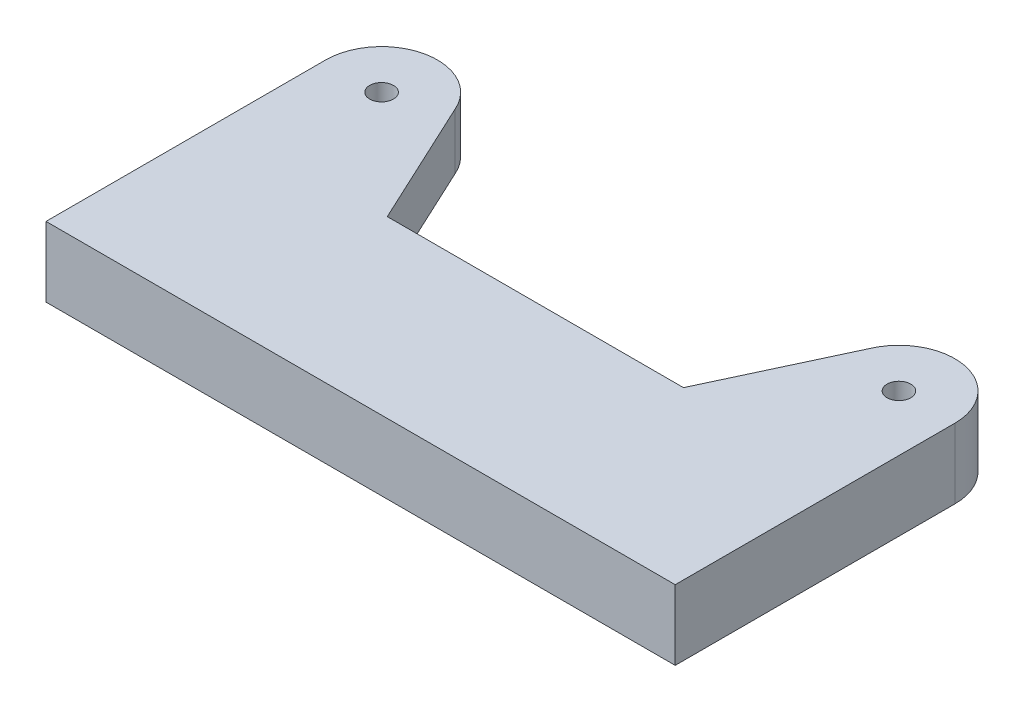
ISO-10303-21;
HEADER;
FILE_DESCRIPTION(('STEP AP214'),'2;1');
FILE_NAME('part.step','',(''),(''),'','','');
FILE_SCHEMA(('AUTOMOTIVE_DESIGN { 1 0 10303 214 1 1 1 1 }'));
ENDSEC;
DATA;
#1=APPLICATION_CONTEXT('core data for automotive mechanical design processes');
#2=APPLICATION_PROTOCOL_DEFINITION('international standard','automotive_design',2000,#1);
#3=PRODUCT_CONTEXT('',#1,'mechanical');
#4=PRODUCT('Part','Part','',(#3));
#5=PRODUCT_RELATED_PRODUCT_CATEGORY('part','',(#4));
#6=PRODUCT_DEFINITION_FORMATION('','',#4);
#7=PRODUCT_DEFINITION_CONTEXT('part definition',#1,'design');
#8=PRODUCT_DEFINITION('design','',#6,#7);
#9=PRODUCT_DEFINITION_SHAPE('','',#8);
#10=(LENGTH_UNIT() NAMED_UNIT(*) SI_UNIT(.MILLI.,.METRE.));
#11=(NAMED_UNIT(*) PLANE_ANGLE_UNIT() SI_UNIT($,.RADIAN.));
#12=(NAMED_UNIT(*) SI_UNIT($,.STERADIAN.) SOLID_ANGLE_UNIT());
#13=UNCERTAINTY_MEASURE_WITH_UNIT(LENGTH_MEASURE(1.E-05),#10,'distance_accuracy_value','');
#14=(GEOMETRIC_REPRESENTATION_CONTEXT(3) GLOBAL_UNCERTAINTY_ASSIGNED_CONTEXT((#13)) GLOBAL_UNIT_ASSIGNED_CONTEXT((#10,
#11,#12)) REPRESENTATION_CONTEXT('',''));
#15=CARTESIAN_POINT('',(0.,0.,0.));
#16=DIRECTION('',(0.,0.,1.));
#17=DIRECTION('',(1.,0.,0.));
#18=AXIS2_PLACEMENT_3D('',#15,#16,#17);
#19=CARTESIAN_POINT('',(0.,2.,0.));
#20=DIRECTION('',(0.,-1.,0.));
#21=DIRECTION('',(0.,0.,-1.));
#22=AXIS2_PLACEMENT_3D('',#19,#20,#21);
#23=PLANE('',#22);
#24=CARTESIAN_POINT('',(-37.,2.,-40.));
#25=DIRECTION('',(0.,-1.,0.));
#26=DIRECTION('',(0.,0.,-1.));
#27=AXIS2_PLACEMENT_3D('',#24,#25,#26);
#28=CIRCLE('',#27,1.7);
#29=CARTESIAN_POINT('',(-37.,2.,-41.7));
#30=VERTEX_POINT('',#29);
#31=EDGE_CURVE('E309',#30,#30,#28,.F.);
#32=ORIENTED_EDGE('',*,*,#31,.T.);
#33=EDGE_LOOP('',(#32));
#34=FACE_BOUND('',#33,.T.);
#35=DIRECTION('',(-1.,0.,0.));
#36=VECTOR('',#35,1.);
#37=CARTESIAN_POINT('',(42.5,2.,-14.9999999999997));
#38=LINE('',#37,#36);
#39=CARTESIAN_POINT('',(41.5,2.,-14.9999999999997));
#40=VERTEX_POINT('',#39);
#41=CARTESIAN_POINT('',(-41.5,2.,-14.9999999999997));
#42=VERTEX_POINT('',#41);
#43=EDGE_CURVE('E157',#40,#42,#38,.T.);
#44=ORIENTED_EDGE('',*,*,#43,.T.);
#45=CARTESIAN_POINT('',(-41.5,2.,-15.9999999999997));
#46=DIRECTION('',(0.,-1.,0.));
#47=DIRECTION('',(0.,0.,-1.));
#48=AXIS2_PLACEMENT_3D('',#45,#46,#47);
#49=CIRCLE('',#48,1.);
#50=CARTESIAN_POINT('',(-42.5,2.,-15.9999999999997));
#51=VERTEX_POINT('',#50);
#52=EDGE_CURVE('E272',#42,#51,#49,.T.);
#53=ORIENTED_EDGE('',*,*,#52,.T.);
#54=DIRECTION('',(0.,0.,-1.));
#55=VECTOR('',#54,1.);
#56=CARTESIAN_POINT('',(-42.5,2.,-47.9999999999999));
#57=LINE('',#56,#55);
#58=CARTESIAN_POINT('',(-42.5,2.,-45.8094750193111));
#59=VERTEX_POINT('',#58);
#60=EDGE_CURVE('E158',#51,#59,#57,.T.);
#61=ORIENTED_EDGE('',*,*,#60,.T.);
#62=CARTESIAN_POINT('',(-37.,2.,-40.));
#63=DIRECTION('',(0.,-1.,0.));
#64=DIRECTION('',(0.,0.,-1.));
#65=AXIS2_PLACEMENT_3D('',#62,#63,#64);
#66=CIRCLE('',#65,7.99999999999995);
#67=CARTESIAN_POINT('',(-29.6360913717861,2.,-43.1261557407327));
#68=VERTEX_POINT('',#67);
#69=EDGE_CURVE('E255',#59,#68,#66,.T.);
#70=ORIENTED_EDGE('',*,*,#69,.T.);
#71=DIRECTION('',(0.422618261740704,0.,0.906307787036648));
#72=VECTOR('',#71,1.);
#73=CARTESIAN_POINT('',(-29.6360913717862,2.,-43.1261557407327));
#74=LINE('',#73,#72);
#75=CARTESIAN_POINT('',(-21.1837261369721,2.,-24.9999999999997));
#76=VERTEX_POINT('',#75);
#77=EDGE_CURVE('E169',#68,#76,#74,.T.);
#78=ORIENTED_EDGE('',*,*,#77,.T.);
#79=DIRECTION('',(1.,0.,0.));
#80=VECTOR('',#79,1.);
#81=CARTESIAN_POINT('',(21.1837261369721,2.,-24.9999999999997));
#82=LINE('',#81,#80);
#83=CARTESIAN_POINT('',(21.1837261369721,2.,-24.9999999999997));
#84=VERTEX_POINT('',#83);
#85=EDGE_CURVE('E178',#76,#84,#82,.T.);
#86=ORIENTED_EDGE('',*,*,#85,.T.);
#87=DIRECTION('',(0.422618261740704,0.,-0.906307787036648));
#88=VECTOR('',#87,1.);
#89=CARTESIAN_POINT('',(29.6360913717862,2.,-43.1261557407327));
#90=LINE('',#89,#88);
#91=CARTESIAN_POINT('',(29.6360913717862,2.,-43.1261557407327));
#92=VERTEX_POINT('',#91);
#93=EDGE_CURVE('E144',#84,#92,#90,.T.);
#94=ORIENTED_EDGE('',*,*,#93,.T.);
#95=CARTESIAN_POINT('',(37.,2.,-40.));
#96=DIRECTION('',(0.,-1.,0.));
#97=DIRECTION('',(0.,0.,-1.));
#98=AXIS2_PLACEMENT_3D('',#95,#96,#97);
#99=CIRCLE('',#98,7.99999999999994);
#100=CARTESIAN_POINT('',(42.5,2.,-45.809475019311));
#101=VERTEX_POINT('',#100);
#102=EDGE_CURVE('E138',#92,#101,#99,.T.);
#103=ORIENTED_EDGE('',*,*,#102,.T.);
#104=DIRECTION('',(0.,0.,1.));
#105=VECTOR('',#104,1.);
#106=CARTESIAN_POINT('',(42.5,2.,-47.9999999999999));
#107=LINE('',#106,#105);
#108=CARTESIAN_POINT('',(42.5,2.,-15.9999999999997));
#109=VERTEX_POINT('',#108);
#110=EDGE_CURVE('E141',#101,#109,#107,.T.);
#111=ORIENTED_EDGE('',*,*,#110,.T.);
#112=CARTESIAN_POINT('',(41.5,2.,-15.9999999999997));
#113=DIRECTION('',(0.,-1.,0.));
#114=DIRECTION('',(0.,0.,-1.));
#115=AXIS2_PLACEMENT_3D('',#112,#113,#114);
#116=CIRCLE('',#115,1.);
#117=EDGE_CURVE('E269',#109,#40,#116,.T.);
#118=ORIENTED_EDGE('',*,*,#117,.T.);
#119=EDGE_LOOP('',(#44,#53,#61,#70,#78,#86,#94,#103,#111,#118));
#120=FACE_BOUND('',#119,.T.);
#121=CARTESIAN_POINT('',(37.,2.,-40.));
#122=DIRECTION('',(0.,-1.,0.));
#123=DIRECTION('',(0.,0.,-1.));
#124=AXIS2_PLACEMENT_3D('',#121,#122,#123);
#125=CIRCLE('',#124,1.7);
#126=CARTESIAN_POINT('',(37.,2.,-41.7));
#127=VERTEX_POINT('',#126);
#128=EDGE_CURVE('E300',#127,#127,#125,.F.);
#129=ORIENTED_EDGE('',*,*,#128,.T.);
#130=EDGE_LOOP('',(#129));
#131=FACE_BOUND('',#130,.T.);
#132=ADVANCED_FACE('F38',(#34,#120,#131),#23,.T.);
#133=CARTESIAN_POINT('',(29.6360913717862,10.,-43.1261557407327));
#134=DIRECTION('',(0.906307787036648,0.,0.422618261740704));
#135=DIRECTION('',(0.422618261740704,0.,-0.906307787036648));
#136=AXIS2_PLACEMENT_3D('',#133,#134,#135);
#137=PLANE('',#136);
#138=ORIENTED_EDGE('',*,*,#93,.F.);
#139=DIRECTION('',(0.,-1.,0.));
#140=VECTOR('',#139,1.);
#141=CARTESIAN_POINT('',(21.1837261369721,10.,-24.9999999999997));
#142=LINE('',#141,#140);
#143=CARTESIAN_POINT('',(21.1837261369721,10.,-24.9999999999997));
#144=VERTEX_POINT('',#143);
#145=EDGE_CURVE('E242',#144,#84,#142,.T.);
#146=ORIENTED_EDGE('',*,*,#145,.F.);
#147=DIRECTION('',(-0.422618261740703,0.,0.906307787036648));
#148=VECTOR('',#147,1.);
#149=CARTESIAN_POINT('',(29.6360913717862,10.,-43.1261557407327));
#150=LINE('',#149,#148);
#151=CARTESIAN_POINT('',(29.6360913717862,10.,-43.1261557407327));
#152=VERTEX_POINT('',#151);
#153=EDGE_CURVE('E191',#152,#144,#150,.T.);
#154=ORIENTED_EDGE('',*,*,#153,.F.);
#155=DIRECTION('',(0.,-1.,0.));
#156=VECTOR('',#155,1.);
#157=CARTESIAN_POINT('',(29.6360913717862,10.,-43.1261557407327));
#158=LINE('',#157,#156);
#159=EDGE_CURVE('E246',#152,#92,#158,.T.);
#160=ORIENTED_EDGE('',*,*,#159,.T.);
#161=EDGE_LOOP('',(#138,#146,#154,#160));
#162=FACE_BOUND('',#161,.T.);
#163=ADVANCED_FACE('F339',(#162),#137,.F.);
#164=CARTESIAN_POINT('',(21.1837261369721,10.,-24.9999999999997));
#165=DIRECTION('',(0.,0.,1.));
#166=DIRECTION('',(1.,0.,0.));
#167=AXIS2_PLACEMENT_3D('',#164,#165,#166);
#168=PLANE('',#167);
#169=ORIENTED_EDGE('',*,*,#85,.F.);
#170=DIRECTION('',(0.,-1.,0.));
#171=VECTOR('',#170,1.);
#172=CARTESIAN_POINT('',(-21.1837261369721,10.,-24.9999999999997));
#173=LINE('',#172,#171);
#174=CARTESIAN_POINT('',(-21.1837261369721,10.,-24.9999999999997));
#175=VERTEX_POINT('',#174);
#176=EDGE_CURVE('E238',#175,#76,#173,.T.);
#177=ORIENTED_EDGE('',*,*,#176,.F.);
#178=DIRECTION('',(-1.,0.,0.));
#179=VECTOR('',#178,1.);
#180=CARTESIAN_POINT('',(21.1837261369721,10.,-24.9999999999997));
#181=LINE('',#180,#179);
#182=EDGE_CURVE('E194',#144,#175,#181,.T.);
#183=ORIENTED_EDGE('',*,*,#182,.F.);
#184=ORIENTED_EDGE('',*,*,#145,.T.);
#185=EDGE_LOOP('',(#169,#177,#183,#184));
#186=FACE_BOUND('',#185,.T.);
#187=ADVANCED_FACE('F346',(#186),#168,.F.);
#188=CARTESIAN_POINT('',(-29.6360913717862,10.,-43.1261557407327));
#189=DIRECTION('',(-0.906307787036648,0.,0.422618261740704));
#190=DIRECTION('',(0.422618261740704,0.,0.906307787036648));
#191=AXIS2_PLACEMENT_3D('',#188,#189,#190);
#192=PLANE('',#191);
#193=ORIENTED_EDGE('',*,*,#77,.F.);
#194=DIRECTION('',(0.,-1.,0.));
#195=VECTOR('',#194,1.);
#196=CARTESIAN_POINT('',(-29.6360913717861,10.,-43.1261557407327));
#197=LINE('',#196,#195);
#198=CARTESIAN_POINT('',(-29.6360913717861,10.,-43.1261557407327));
#199=VERTEX_POINT('',#198);
#200=EDGE_CURVE('E234',#199,#68,#197,.T.);
#201=ORIENTED_EDGE('',*,*,#200,.F.);
#202=DIRECTION('',(-0.422618261740703,0.,-0.906307787036648));
#203=VECTOR('',#202,1.);
#204=CARTESIAN_POINT('',(-29.6360913717862,10.,-43.1261557407327));
#205=LINE('',#204,#203);
#206=EDGE_CURVE('E197',#175,#199,#205,.T.);
#207=ORIENTED_EDGE('',*,*,#206,.F.);
#208=ORIENTED_EDGE('',*,*,#176,.T.);
#209=EDGE_LOOP('',(#193,#201,#207,#208));
#210=FACE_BOUND('',#209,.T.);
#211=ADVANCED_FACE('F349',(#210),#192,.F.);
#212=CARTESIAN_POINT('',(45.,10.,0.));
#213=DIRECTION('',(-1.,0.,0.));
#214=DIRECTION('',(0.,0.,1.));
#215=AXIS2_PLACEMENT_3D('',#212,#213,#214);
#216=PLANE('',#215);
#217=DIRECTION('',(0.,0.,-1.));
#218=VECTOR('',#217,1.);
#219=CARTESIAN_POINT('',(45.,0.,0.));
#220=LINE('',#219,#218);
#221=CARTESIAN_POINT('',(45.,0.,0.));
#222=VERTEX_POINT('',#221);
#223=CARTESIAN_POINT('',(44.9999999999999,0.,-40.));
#224=VERTEX_POINT('',#223);
#225=EDGE_CURVE('E150',#222,#224,#220,.T.);
#226=ORIENTED_EDGE('',*,*,#225,.T.);
#227=DIRECTION('',(0.,-1.,0.));
#228=VECTOR('',#227,1.);
#229=CARTESIAN_POINT('',(44.9999999999999,10.,-40.));
#230=LINE('',#229,#228);
#231=CARTESIAN_POINT('',(44.9999999999999,10.,-40.));
#232=VERTEX_POINT('',#231);
#233=EDGE_CURVE('E249',#232,#224,#230,.T.);
#234=ORIENTED_EDGE('',*,*,#233,.F.);
#235=DIRECTION('',(0.,0.,-1.));
#236=VECTOR('',#235,1.);
#237=CARTESIAN_POINT('',(45.,10.,0.));
#238=LINE('',#237,#236);
#239=CARTESIAN_POINT('',(45.,10.,0.));
#240=VERTEX_POINT('',#239);
#241=EDGE_CURVE('E183',#240,#232,#238,.T.);
#242=ORIENTED_EDGE('',*,*,#241,.F.);
#243=DIRECTION('',(0.,-1.,0.));
#244=VECTOR('',#243,1.);
#245=CARTESIAN_POINT('',(45.,10.,0.));
#246=LINE('',#245,#244);
#247=EDGE_CURVE('E209',#240,#222,#246,.T.);
#248=ORIENTED_EDGE('',*,*,#247,.T.);
#249=EDGE_LOOP('',(#226,#234,#242,#248));
#250=FACE_BOUND('',#249,.T.);
#251=ADVANCED_FACE('F334',(#250),#216,.F.);
#252=CARTESIAN_POINT('',(37.,10.,-40.));
#253=DIRECTION('',(0.,-1.,0.));
#254=DIRECTION('',(0.,0.,-1.));
#255=AXIS2_PLACEMENT_3D('',#252,#253,#254);
#256=CYLINDRICAL_SURFACE('',#255,7.99999999999994);
#257=CARTESIAN_POINT('',(37.,0.,-40.));
#258=DIRECTION('',(0.,1.,0.));
#259=DIRECTION('',(0.,0.,1.));
#260=AXIS2_PLACEMENT_3D('',#257,#258,#259);
#261=CIRCLE('',#260,7.99999999999994);
#262=CARTESIAN_POINT('',(42.5,0.,-45.809475019311));
#263=VERTEX_POINT('',#262);
#264=EDGE_CURVE('E162',#224,#263,#261,.T.);
#265=ORIENTED_EDGE('',*,*,#264,.T.);
#266=DIRECTION('',(0.,-1.,0.));
#267=VECTOR('',#266,1.);
#268=CARTESIAN_POINT('',(42.5,10.,-45.809475019311));
#269=LINE('',#268,#267);
#270=EDGE_CURVE('E154',#263,#101,#269,.F.);
#271=ORIENTED_EDGE('',*,*,#270,.T.);
#272=ORIENTED_EDGE('',*,*,#102,.F.);
#273=ORIENTED_EDGE('',*,*,#159,.F.);
#274=CARTESIAN_POINT('',(37.,10.,-40.));
#275=DIRECTION('',(0.,1.,0.));
#276=DIRECTION('',(0.,0.,1.));
#277=AXIS2_PLACEMENT_3D('',#274,#275,#276);
#278=CIRCLE('',#277,7.99999999999994);
#279=EDGE_CURVE('E187',#232,#152,#278,.T.);
#280=ORIENTED_EDGE('',*,*,#279,.F.);
#281=ORIENTED_EDGE('',*,*,#233,.T.);
#282=EDGE_LOOP('',(#265,#271,#272,#273,#280,#281));
#283=FACE_BOUND('',#282,.T.);
#284=ADVANCED_FACE('F160',(#283),#256,.T.);
#285=CARTESIAN_POINT('',(-37.,10.,-40.));
#286=DIRECTION('',(0.,-1.,0.));
#287=DIRECTION('',(0.,0.,-1.));
#288=AXIS2_PLACEMENT_3D('',#285,#286,#287);
#289=CYLINDRICAL_SURFACE('',#288,7.99999999999995);
#290=ORIENTED_EDGE('',*,*,#69,.F.);
#291=DIRECTION('',(0.,-1.,0.));
#292=VECTOR('',#291,1.);
#293=CARTESIAN_POINT('',(-42.5,10.,-45.8094750193111));
#294=LINE('',#293,#292);
#295=CARTESIAN_POINT('',(-42.5,0.,-45.8094750193111));
#296=VERTEX_POINT('',#295);
#297=EDGE_CURVE('E164',#59,#296,#294,.T.);
#298=ORIENTED_EDGE('',*,*,#297,.T.);
#299=CARTESIAN_POINT('',(-37.,0.,-40.));
#300=DIRECTION('',(0.,1.,0.));
#301=DIRECTION('',(0.,0.,-1.));
#302=AXIS2_PLACEMENT_3D('',#299,#300,#301);
#303=CIRCLE('',#302,7.99999999999995);
#304=CARTESIAN_POINT('',(-45.,0.,-40.));
#305=VERTEX_POINT('',#304);
#306=EDGE_CURVE('E215',#296,#305,#303,.T.);
#307=ORIENTED_EDGE('',*,*,#306,.T.);
#308=DIRECTION('',(0.,-1.,0.));
#309=VECTOR('',#308,1.);
#310=CARTESIAN_POINT('',(-45.,10.,-40.));
#311=LINE('',#310,#309);
#312=CARTESIAN_POINT('',(-45.,10.,-40.));
#313=VERTEX_POINT('',#312);
#314=EDGE_CURVE('E230',#313,#305,#311,.T.);
#315=ORIENTED_EDGE('',*,*,#314,.F.);
#316=CARTESIAN_POINT('',(-37.,10.,-40.));
#317=DIRECTION('',(0.,1.,0.));
#318=DIRECTION('',(0.,0.,-1.));
#319=AXIS2_PLACEMENT_3D('',#316,#317,#318);
#320=CIRCLE('',#319,7.99999999999995);
#321=EDGE_CURVE('E200',#199,#313,#320,.T.);
#322=ORIENTED_EDGE('',*,*,#321,.F.);
#323=ORIENTED_EDGE('',*,*,#200,.T.);
#324=EDGE_LOOP('',(#290,#298,#307,#315,#322,#323));
#325=FACE_BOUND('',#324,.T.);
#326=ADVANCED_FACE('F353',(#325),#289,.T.);
#327=CARTESIAN_POINT('',(-45.,10.,3.08708132938538E-13));
#328=DIRECTION('',(1.,0.,0.));
#329=DIRECTION('',(0.,0.,-1.));
#330=AXIS2_PLACEMENT_3D('',#327,#328,#329);
#331=PLANE('',#330);
#332=DIRECTION('',(0.,0.,1.));
#333=VECTOR('',#332,1.);
#334=CARTESIAN_POINT('',(-45.,0.,3.08708132938538E-13));
#335=LINE('',#334,#333);
#336=CARTESIAN_POINT('',(-45.,0.,3.08708132938538E-13));
#337=VERTEX_POINT('',#336);
#338=EDGE_CURVE('E218',#305,#337,#335,.T.);
#339=ORIENTED_EDGE('',*,*,#338,.T.);
#340=DIRECTION('',(0.,-1.,0.));
#341=VECTOR('',#340,1.);
#342=CARTESIAN_POINT('',(-45.,10.,3.08708132938538E-13));
#343=LINE('',#342,#341);
#344=CARTESIAN_POINT('',(-45.,10.,3.08708132938538E-13));
#345=VERTEX_POINT('',#344);
#346=EDGE_CURVE('E226',#345,#337,#343,.T.);
#347=ORIENTED_EDGE('',*,*,#346,.F.);
#348=DIRECTION('',(0.,0.,1.));
#349=VECTOR('',#348,1.);
#350=CARTESIAN_POINT('',(-45.,10.,3.08708132938538E-13));
#351=LINE('',#350,#349);
#352=EDGE_CURVE('E203',#313,#345,#351,.T.);
#353=ORIENTED_EDGE('',*,*,#352,.F.);
#354=ORIENTED_EDGE('',*,*,#314,.T.);
#355=EDGE_LOOP('',(#339,#347,#353,#354));
#356=FACE_BOUND('',#355,.T.);
#357=ADVANCED_FACE('F357',(#356),#331,.F.);
#358=CARTESIAN_POINT('',(45.,10.,0.));
#359=DIRECTION('',(0.,0.,-1.));
#360=DIRECTION('',(-1.,0.,0.));
#361=AXIS2_PLACEMENT_3D('',#358,#359,#360);
#362=PLANE('',#361);
#363=DIRECTION('',(1.,0.,0.));
#364=VECTOR('',#363,1.);
#365=CARTESIAN_POINT('',(45.,0.,0.));
#366=LINE('',#365,#364);
#367=EDGE_CURVE('E188',#337,#222,#366,.T.);
#368=ORIENTED_EDGE('',*,*,#367,.T.);
#369=ORIENTED_EDGE('',*,*,#247,.F.);
#370=DIRECTION('',(1.,0.,0.));
#371=VECTOR('',#370,1.);
#372=CARTESIAN_POINT('',(45.,10.,0.));
#373=LINE('',#372,#371);
#374=EDGE_CURVE('E206',#345,#240,#373,.T.);
#375=ORIENTED_EDGE('',*,*,#374,.F.);
#376=ORIENTED_EDGE('',*,*,#346,.T.);
#377=EDGE_LOOP('',(#368,#369,#375,#376));
#378=FACE_BOUND('',#377,.T.);
#379=ADVANCED_FACE('F326',(#378),#362,.F.);
#380=CARTESIAN_POINT('',(37.,10.,-40.));
#381=DIRECTION('',(0.,1.,0.));
#382=DIRECTION('',(0.,0.,1.));
#383=AXIS2_PLACEMENT_3D('',#380,#381,#382);
#384=PLANE('',#383);
#385=CARTESIAN_POINT('',(-37.,10.,-40.));
#386=DIRECTION('',(0.,1.,0.));
#387=DIRECTION('',(0.,0.,1.));
#388=AXIS2_PLACEMENT_3D('',#385,#386,#387);
#389=CIRCLE('',#388,1.69999999999999);
#390=CARTESIAN_POINT('',(-37.,10.,-38.3));
#391=VERTEX_POINT('',#390);
#392=EDGE_CURVE('E314',#391,#391,#389,.T.);
#393=ORIENTED_EDGE('',*,*,#392,.F.);
#394=EDGE_LOOP('',(#393));
#395=FACE_BOUND('',#394,.T.);
#396=CARTESIAN_POINT('',(37.,10.,-40.));
#397=DIRECTION('',(0.,1.,0.));
#398=DIRECTION('',(0.,0.,1.));
#399=AXIS2_PLACEMENT_3D('',#396,#397,#398);
#400=CIRCLE('',#399,1.69999999999999);
#401=CARTESIAN_POINT('',(37.,10.,-38.3));
#402=VERTEX_POINT('',#401);
#403=EDGE_CURVE('E305',#402,#402,#400,.T.);
#404=ORIENTED_EDGE('',*,*,#403,.F.);
#405=EDGE_LOOP('',(#404));
#406=FACE_BOUND('',#405,.T.);
#407=ORIENTED_EDGE('',*,*,#241,.T.);
#408=ORIENTED_EDGE('',*,*,#279,.T.);
#409=ORIENTED_EDGE('',*,*,#153,.T.);
#410=ORIENTED_EDGE('',*,*,#182,.T.);
#411=ORIENTED_EDGE('',*,*,#206,.T.);
#412=ORIENTED_EDGE('',*,*,#321,.T.);
#413=ORIENTED_EDGE('',*,*,#352,.T.);
#414=ORIENTED_EDGE('',*,*,#374,.T.);
#415=EDGE_LOOP('',(#407,#408,#409,#410,#411,#412,#413,#414));
#416=FACE_BOUND('',#415,.T.);
#417=ADVANCED_FACE('F323',(#395,#406,#416),#384,.T.);
#418=CARTESIAN_POINT('',(37.,0.,-40.));
#419=DIRECTION('',(0.,1.,0.));
#420=DIRECTION('',(0.,0.,1.));
#421=AXIS2_PLACEMENT_3D('',#418,#419,#420);
#422=PLANE('',#421);
#423=ORIENTED_EDGE('',*,*,#306,.F.);
#424=DIRECTION('',(0.,0.,-1.));
#425=VECTOR('',#424,1.);
#426=CARTESIAN_POINT('',(-42.5,0.,-47.9999999999999));
#427=LINE('',#426,#425);
#428=CARTESIAN_POINT('',(-42.5,0.,-15.9999999999997));
#429=VERTEX_POINT('',#428);
#430=EDGE_CURVE('E281',#429,#296,#427,.T.);
#431=ORIENTED_EDGE('',*,*,#430,.F.);
#432=CARTESIAN_POINT('',(-41.5,0.,-15.9999999999997));
#433=DIRECTION('',(0.,1.,0.));
#434=DIRECTION('',(0.,0.,1.));
#435=AXIS2_PLACEMENT_3D('',#432,#433,#434);
#436=CIRCLE('',#435,1.);
#437=CARTESIAN_POINT('',(-41.5,0.,-14.9999999999997));
#438=VERTEX_POINT('',#437);
#439=EDGE_CURVE('E47',#429,#438,#436,.T.);
#440=ORIENTED_EDGE('',*,*,#439,.T.);
#441=DIRECTION('',(-1.,0.,0.));
#442=VECTOR('',#441,1.);
#443=CARTESIAN_POINT('',(42.5,0.,-14.9999999999997));
#444=LINE('',#443,#442);
#445=CARTESIAN_POINT('',(41.5,0.,-14.9999999999997));
#446=VERTEX_POINT('',#445);
#447=EDGE_CURVE('E173',#446,#438,#444,.T.);
#448=ORIENTED_EDGE('',*,*,#447,.F.);
#449=CARTESIAN_POINT('',(41.5,0.,-15.9999999999997));
#450=DIRECTION('',(0.,1.,0.));
#451=DIRECTION('',(0.,0.,1.));
#452=AXIS2_PLACEMENT_3D('',#449,#450,#451);
#453=CIRCLE('',#452,1.);
#454=CARTESIAN_POINT('',(42.5,0.,-15.9999999999997));
#455=VERTEX_POINT('',#454);
#456=EDGE_CURVE('E11',#446,#455,#453,.T.);
#457=ORIENTED_EDGE('',*,*,#456,.T.);
#458=DIRECTION('',(0.,0.,-1.));
#459=VECTOR('',#458,1.);
#460=CARTESIAN_POINT('',(42.5,0.,-40.));
#461=LINE('',#460,#459);
#462=EDGE_CURVE('E252',#455,#263,#461,.T.);
#463=ORIENTED_EDGE('',*,*,#462,.T.);
#464=ORIENTED_EDGE('',*,*,#264,.F.);
#465=ORIENTED_EDGE('',*,*,#225,.F.);
#466=ORIENTED_EDGE('',*,*,#367,.F.);
#467=ORIENTED_EDGE('',*,*,#338,.F.);
#468=EDGE_LOOP('',(#423,#431,#440,#448,#457,#463,#464,#465,#466,#467));
#469=FACE_BOUND('',#468,.T.);
#470=ADVANCED_FACE('F280',(#469),#422,.F.);
#471=CARTESIAN_POINT('',(-42.5,2.,-47.9999999999999));
#472=DIRECTION('',(-1.,0.,0.));
#473=DIRECTION('',(0.,0.,1.));
#474=AXIS2_PLACEMENT_3D('',#471,#472,#473);
#475=PLANE('',#474);
#476=ORIENTED_EDGE('',*,*,#60,.F.);
#477=DIRECTION('',(0.,-1.,0.));
#478=VECTOR('',#477,1.);
#479=CARTESIAN_POINT('',(-42.5,0.,-15.9999999999997));
#480=LINE('',#479,#478);
#481=EDGE_CURVE('E258',#51,#429,#480,.T.);
#482=ORIENTED_EDGE('',*,*,#481,.T.);
#483=ORIENTED_EDGE('',*,*,#430,.T.);
#484=ORIENTED_EDGE('',*,*,#297,.F.);
#485=EDGE_LOOP('',(#476,#482,#483,#484));
#486=FACE_BOUND('',#485,.T.);
#487=ADVANCED_FACE('F295',(#486),#475,.F.);
#488=CARTESIAN_POINT('',(42.5,2.,-47.9999999999999));
#489=DIRECTION('',(1.,0.,0.));
#490=DIRECTION('',(0.,0.,-1.));
#491=AXIS2_PLACEMENT_3D('',#488,#489,#490);
#492=PLANE('',#491);
#493=ORIENTED_EDGE('',*,*,#462,.F.);
#494=DIRECTION('',(0.,-1.,0.));
#495=VECTOR('',#494,1.);
#496=CARTESIAN_POINT('',(42.5,2.,-15.9999999999997));
#497=LINE('',#496,#495);
#498=EDGE_CURVE('E59',#455,#109,#497,.F.);
#499=ORIENTED_EDGE('',*,*,#498,.T.);
#500=ORIENTED_EDGE('',*,*,#110,.F.);
#501=ORIENTED_EDGE('',*,*,#270,.F.);
#502=EDGE_LOOP('',(#493,#499,#500,#501));
#503=FACE_BOUND('',#502,.T.);
#504=ADVANCED_FACE('F153',(#503),#492,.F.);
#505=CARTESIAN_POINT('',(42.5,2.,-14.9999999999997));
#506=DIRECTION('',(0.,0.,1.));
#507=DIRECTION('',(1.,0.,0.));
#508=AXIS2_PLACEMENT_3D('',#505,#506,#507);
#509=PLANE('',#508);
#510=ORIENTED_EDGE('',*,*,#447,.T.);
#511=DIRECTION('',(0.,-1.,0.));
#512=VECTOR('',#511,1.);
#513=CARTESIAN_POINT('',(-41.5,2.,-14.9999999999997));
#514=LINE('',#513,#512);
#515=EDGE_CURVE('E266',#438,#42,#514,.F.);
#516=ORIENTED_EDGE('',*,*,#515,.T.);
#517=ORIENTED_EDGE('',*,*,#43,.F.);
#518=DIRECTION('',(0.,-1.,0.));
#519=VECTOR('',#518,1.);
#520=CARTESIAN_POINT('',(41.5,0.,-14.9999999999997));
#521=LINE('',#520,#519);
#522=EDGE_CURVE('E262',#40,#446,#521,.T.);
#523=ORIENTED_EDGE('',*,*,#522,.T.);
#524=EDGE_LOOP('',(#510,#516,#517,#523));
#525=FACE_BOUND('',#524,.T.);
#526=ADVANCED_FACE('F286',(#525),#509,.F.);
#527=CARTESIAN_POINT('',(-41.5,2.,-15.9999999999997));
#528=DIRECTION('',(0.,1.,0.));
#529=DIRECTION('',(0.,0.,1.));
#530=AXIS2_PLACEMENT_3D('',#527,#528,#529);
#531=CYLINDRICAL_SURFACE('',#530,1.);
#532=ORIENTED_EDGE('',*,*,#52,.F.);
#533=ORIENTED_EDGE('',*,*,#515,.F.);
#534=ORIENTED_EDGE('',*,*,#439,.F.);
#535=ORIENTED_EDGE('',*,*,#481,.F.);
#536=EDGE_LOOP('',(#532,#533,#534,#535));
#537=FACE_BOUND('',#536,.T.);
#538=ADVANCED_FACE('F291',(#537),#531,.F.);
#539=CARTESIAN_POINT('',(41.5,2.,-15.9999999999997));
#540=DIRECTION('',(0.,1.,0.));
#541=DIRECTION('',(0.,0.,1.));
#542=AXIS2_PLACEMENT_3D('',#539,#540,#541);
#543=CYLINDRICAL_SURFACE('',#542,1.);
#544=ORIENTED_EDGE('',*,*,#117,.F.);
#545=ORIENTED_EDGE('',*,*,#498,.F.);
#546=ORIENTED_EDGE('',*,*,#456,.F.);
#547=ORIENTED_EDGE('',*,*,#522,.F.);
#548=EDGE_LOOP('',(#544,#545,#546,#547));
#549=FACE_BOUND('',#548,.T.);
#550=ADVANCED_FACE('F40',(#549),#543,.F.);
#551=CARTESIAN_POINT('',(37.,10.,-40.));
#552=DIRECTION('',(0.,1.,0.));
#553=DIRECTION('',(0.,0.,1.));
#554=AXIS2_PLACEMENT_3D('',#551,#552,#553);
#555=CYLINDRICAL_SURFACE('',#554,1.7);
#556=ORIENTED_EDGE('',*,*,#128,.F.);
#557=EDGE_LOOP('',(#556));
#558=FACE_BOUND('',#557,.T.);
#559=ORIENTED_EDGE('',*,*,#403,.T.);
#560=EDGE_LOOP('',(#559));
#561=FACE_BOUND('',#560,.T.);
#562=ADVANCED_FACE('F363',(#558,#561),#555,.F.);
#563=CARTESIAN_POINT('',(-37.,10.,-40.));
#564=DIRECTION('',(0.,1.,0.));
#565=DIRECTION('',(0.,0.,1.));
#566=AXIS2_PLACEMENT_3D('',#563,#564,#565);
#567=CYLINDRICAL_SURFACE('',#566,1.7);
#568=ORIENTED_EDGE('',*,*,#31,.F.);
#569=EDGE_LOOP('',(#568));
#570=FACE_BOUND('',#569,.T.);
#571=ORIENTED_EDGE('',*,*,#392,.T.);
#572=EDGE_LOOP('',(#571));
#573=FACE_BOUND('',#572,.T.);
#574=ADVANCED_FACE('F321',(#570,#573),#567,.F.);
#575=CLOSED_SHELL('',(#132,#163,#187,#211,#251,#284,#326,#357,#379,#417,#470,#487,#504,#526,
#538,#550,#562,#574));
#576=MANIFOLD_SOLID_BREP('B2',#575);
#577=ADVANCED_BREP_SHAPE_REPRESENTATION('',(#18,#576),#14);
#578=SHAPE_DEFINITION_REPRESENTATION(#9,#577);
ENDSEC;
END-ISO-10303-21;
